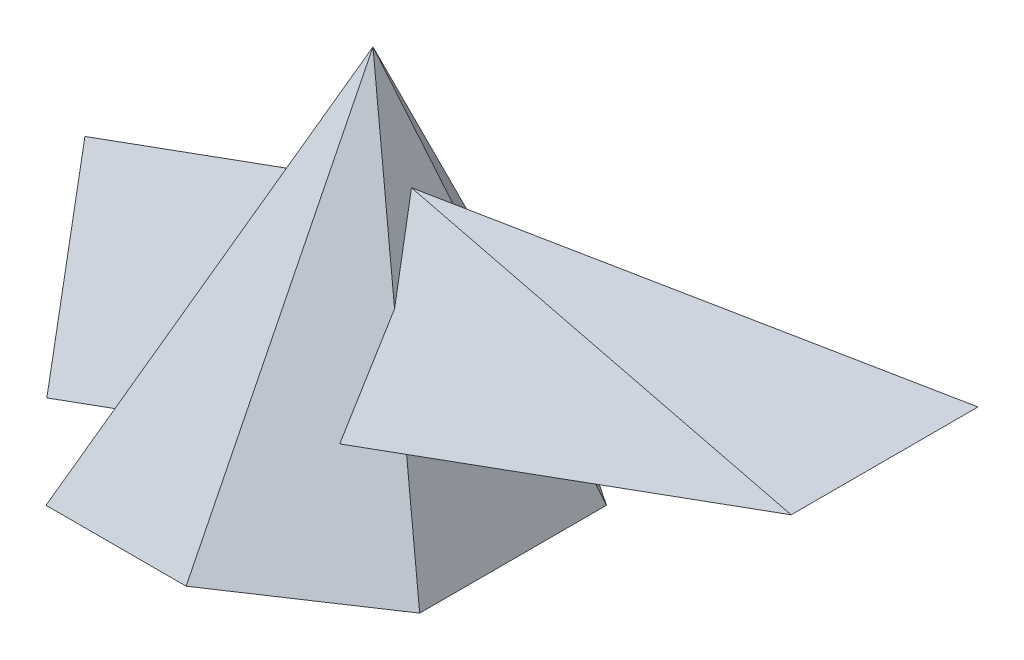
ISO-10303-21;
HEADER;
FILE_DESCRIPTION(('STEP AP214'),'2;1');
FILE_NAME('part.step','',(''),(''),'','','');
FILE_SCHEMA(('AUTOMOTIVE_DESIGN { 1 0 10303 214 1 1 1 1 }'));
ENDSEC;
DATA;
#1=APPLICATION_CONTEXT('core data for automotive mechanical design processes');
#2=APPLICATION_PROTOCOL_DEFINITION('international standard','automotive_design',2000,#1);
#3=PRODUCT_CONTEXT('',#1,'mechanical');
#4=PRODUCT('Part','Part','',(#3));
#5=PRODUCT_RELATED_PRODUCT_CATEGORY('part','',(#4));
#6=PRODUCT_DEFINITION_FORMATION('','',#4);
#7=PRODUCT_DEFINITION_CONTEXT('part definition',#1,'design');
#8=PRODUCT_DEFINITION('design','',#6,#7);
#9=PRODUCT_DEFINITION_SHAPE('','',#8);
#10=(LENGTH_UNIT() NAMED_UNIT(*) SI_UNIT(.MILLI.,.METRE.));
#11=(NAMED_UNIT(*) PLANE_ANGLE_UNIT() SI_UNIT($,.RADIAN.));
#12=(NAMED_UNIT(*) SI_UNIT($,.STERADIAN.) SOLID_ANGLE_UNIT());
#13=UNCERTAINTY_MEASURE_WITH_UNIT(LENGTH_MEASURE(1.E-05),#10,'distance_accuracy_value','');
#14=(GEOMETRIC_REPRESENTATION_CONTEXT(3) GLOBAL_UNCERTAINTY_ASSIGNED_CONTEXT((#13)) GLOBAL_UNIT_ASSIGNED_CONTEXT((#10,
#11,#12)) REPRESENTATION_CONTEXT('',''));
#15=CARTESIAN_POINT('',(0.,0.,0.));
#16=DIRECTION('',(0.,0.,1.));
#17=DIRECTION('',(1.,0.,0.));
#18=AXIS2_PLACEMENT_3D('',#15,#16,#17);
#19=CARTESIAN_POINT('',(52.6027397260274,19.7260273972603,0.));
#20=DIRECTION('',(-0.936329177569044,-0.351123441588392,0.));
#21=DIRECTION('',(0.351123441588392,-0.936329177569045,0.));
#22=AXIS2_PLACEMENT_3D('',#19,#20,#21);
#23=PLANE('',#22);
#24=DIRECTION('',(-0.304085400167954,0.810894400447878,-0.499982340415111));
#25=VECTOR('',#24,1.);
#26=CARTESIAN_POINT('',(49.0148082534701,29.2938446574132,17.6996791747224));
#27=LINE('',#26,#25);
#28=CARTESIAN_POINT('',(43.8763095888053,42.9965077631859,9.25087305920352));
#29=VERTEX_POINT('',#28);
#30=CARTESIAN_POINT('',(38.25,58.,0.));
#31=VERTEX_POINT('',#30);
#32=EDGE_CURVE('E160',#29,#31,#27,.T.);
#33=ORIENTED_EDGE('',*,*,#32,.T.);
#34=DIRECTION('',(0.304085400167954,-0.810894400447878,-0.499982340415111));
#35=VECTOR('',#34,1.);
#36=CARTESIAN_POINT('',(49.0148082534701,29.2938446574132,-17.6996791747224));
#37=LINE('',#36,#35);
#38=CARTESIAN_POINT('',(43.8763095888053,42.9965077631859,-9.25087305920354));
#39=VERTEX_POINT('',#38);
#40=EDGE_CURVE('E166',#31,#39,#37,.T.);
#41=ORIENTED_EDGE('',*,*,#40,.T.);
#42=DIRECTION('',(-0.341881729378914,0.911684611677104,0.227921152919276));
#43=VECTOR('',#42,1.);
#44=CARTESIAN_POINT('',(60.,0.,-20.));
#45=LINE('',#44,#43);
#46=CARTESIAN_POINT('',(30.,80.,0.));
#47=VERTEX_POINT('',#46);
#48=EDGE_CURVE('E346',#39,#47,#45,.T.);
#49=ORIENTED_EDGE('',*,*,#48,.T.);
#50=DIRECTION('',(-0.341881729378914,0.911684611677104,-0.227921152919276));
#51=VECTOR('',#50,1.);
#52=CARTESIAN_POINT('',(60.,0.,20.));
#53=LINE('',#52,#51);
#54=EDGE_CURVE('E172',#29,#47,#53,.T.);
#55=ORIENTED_EDGE('',*,*,#54,.F.);
#56=EDGE_LOOP('',(#33,#41,#49,#55));
#57=FACE_BOUND('',#56,.T.);
#58=ADVANCED_FACE('F41',(#57),#23,.F.);
#59=CARTESIAN_POINT('',(0.,0.,0.));
#60=DIRECTION('',(0.,1.,0.));
#61=DIRECTION('',(0.,0.,1.));
#62=AXIS2_PLACEMENT_3D('',#59,#60,#61);
#63=PLANE('',#62);
#64=DIRECTION('',(-1.,0.,0.));
#65=VECTOR('',#64,1.);
#66=CARTESIAN_POINT('',(30.,0.,-40.));
#67=LINE('',#66,#65);
#68=CARTESIAN_POINT('',(30.,0.,-40.));
#69=VERTEX_POINT('',#68);
#70=CARTESIAN_POINT('',(0.,0.,-40.));
#71=VERTEX_POINT('',#70);
#72=EDGE_CURVE('E221',#69,#71,#67,.T.);
#73=ORIENTED_EDGE('',*,*,#72,.F.);
#74=DIRECTION('',(-0.832050294337844,0.,-0.554700196225229));
#75=VECTOR('',#74,1.);
#76=CARTESIAN_POINT('',(60.,0.,-20.));
#77=LINE('',#76,#75);
#78=CARTESIAN_POINT('',(60.,0.,-20.));
#79=VERTEX_POINT('',#78);
#80=EDGE_CURVE('E178',#79,#69,#77,.T.);
#81=ORIENTED_EDGE('',*,*,#80,.F.);
#82=DIRECTION('',(0.,0.,-1.));
#83=VECTOR('',#82,1.);
#84=CARTESIAN_POINT('',(60.,0.,20.));
#85=LINE('',#84,#83);
#86=CARTESIAN_POINT('',(60.,0.,20.));
#87=VERTEX_POINT('',#86);
#88=EDGE_CURVE('E227',#87,#79,#85,.T.);
#89=ORIENTED_EDGE('',*,*,#88,.F.);
#90=DIRECTION('',(0.832050294337844,0.,-0.554700196225229));
#91=VECTOR('',#90,1.);
#92=CARTESIAN_POINT('',(30.,0.,40.));
#93=LINE('',#92,#91);
#94=CARTESIAN_POINT('',(30.,0.,40.));
#95=VERTEX_POINT('',#94);
#96=EDGE_CURVE('E245',#95,#87,#93,.T.);
#97=ORIENTED_EDGE('',*,*,#96,.F.);
#98=DIRECTION('',(1.,0.,0.));
#99=VECTOR('',#98,1.);
#100=CARTESIAN_POINT('',(0.,0.,40.));
#101=LINE('',#100,#99);
#102=CARTESIAN_POINT('',(0.,0.,40.));
#103=VERTEX_POINT('',#102);
#104=EDGE_CURVE('E248',#103,#95,#101,.T.);
#105=ORIENTED_EDGE('',*,*,#104,.F.);
#106=DIRECTION('',(0.,0.,1.));
#107=VECTOR('',#106,1.);
#108=CARTESIAN_POINT('',(0.,0.,-40.));
#109=LINE('',#108,#107);
#110=EDGE_CURVE('E266',#71,#103,#109,.T.);
#111=ORIENTED_EDGE('',*,*,#110,.F.);
#112=EDGE_LOOP('',(#73,#81,#89,#97,#105,#111));
#113=FACE_BOUND('',#112,.T.);
#114=ADVANCED_FACE('F197',(#113),#63,.F.);
#115=CARTESIAN_POINT('',(23.6065573770492,17.7049180327869,-35.4098360655738));
#116=DIRECTION('',(-0.512147519731584,-0.384110639798688,0.768221279597376));
#117=DIRECTION('',(0.832050294337844,0.,0.554700196225229));
#118=AXIS2_PLACEMENT_3D('',#115,#116,#117);
#119=PLANE('',#118);
#120=ORIENTED_EDGE('',*,*,#48,.F.);
#121=DIRECTION('',(-0.0433970649010113,-0.881712208041471,-0.46978748062141));
#122=VECTOR('',#121,1.);
#123=CARTESIAN_POINT('',(42.3370719174574,11.7233179979222,-25.9136263894006));
#124=LINE('',#123,#122);
#125=CARTESIAN_POINT('',(42.8833487741366,22.8222016344845,-20.));
#126=VERTEX_POINT('',#125);
#127=EDGE_CURVE('E169',#39,#126,#124,.T.);
#128=ORIENTED_EDGE('',*,*,#127,.T.);
#129=DIRECTION('',(0.734681837048884,0.26740232034181,0.623489051536828));
#130=VECTOR('',#129,1.);
#131=CARTESIAN_POINT('',(24.4145155462493,16.1000960779068,-35.6736082635471));
#132=LINE('',#131,#130);
#133=CARTESIAN_POINT('',(50.4138456236469,25.5630783369416,-13.6092304157646));
#134=VERTEX_POINT('',#133);
#135=EDGE_CURVE('E154',#126,#134,#132,.T.);
#136=ORIENTED_EDGE('',*,*,#135,.T.);
#137=EDGE_CURVE('E184',#79,#134,#45,.T.);
#138=ORIENTED_EDGE('',*,*,#137,.F.);
#139=ORIENTED_EDGE('',*,*,#80,.T.);
#140=DIRECTION('',(0.,0.894427190999916,0.447213595499958));
#141=VECTOR('',#140,1.);
#142=CARTESIAN_POINT('',(30.,0.,-40.));
#143=LINE('',#142,#141);
#144=EDGE_CURVE('E343',#69,#47,#143,.T.);
#145=ORIENTED_EDGE('',*,*,#144,.T.);
#146=EDGE_LOOP('',(#120,#128,#136,#138,#139,#145));
#147=FACE_BOUND('',#146,.T.);
#148=ADVANCED_FACE('F186',(#147),#119,.F.);
#149=ORIENTED_EDGE('',*,*,#137,.T.);
#150=DIRECTION('',(0.,0.,1.));
#151=VECTOR('',#150,1.);
#152=CARTESIAN_POINT('',(50.4138456236469,25.5630783369416,0.));
#153=LINE('',#152,#151);
#154=CARTESIAN_POINT('',(50.4138456236469,25.5630783369417,13.6092304157646));
#155=VERTEX_POINT('',#154);
#156=EDGE_CURVE('E145',#134,#155,#153,.T.);
#157=ORIENTED_EDGE('',*,*,#156,.T.);
#158=EDGE_CURVE('E283',#87,#155,#53,.T.);
#159=ORIENTED_EDGE('',*,*,#158,.F.);
#160=ORIENTED_EDGE('',*,*,#88,.T.);
#161=EDGE_LOOP('',(#149,#157,#159,#160));
#162=FACE_BOUND('',#161,.T.);
#163=ADVANCED_FACE('F196',(#162),#23,.F.);
#164=CARTESIAN_POINT('',(0.,16.,-32.));
#165=DIRECTION('',(0.,-0.447213595499958,0.894427190999916));
#166=DIRECTION('',(0.,-0.894427190999916,-0.447213595499958));
#167=AXIS2_PLACEMENT_3D('',#164,#165,#166);
#168=PLANE('',#167);
#169=DIRECTION('',(0.317999364001908,0.847998304005088,0.423999152002544));
#170=VECTOR('',#169,1.);
#171=CARTESIAN_POINT('',(0.,0.,-40.));
#172=LINE('',#171,#170);
#173=EDGE_CURVE('E337',#71,#47,#172,.T.);
#174=ORIENTED_EDGE('',*,*,#173,.T.);
#175=ORIENTED_EDGE('',*,*,#144,.F.);
#176=ORIENTED_EDGE('',*,*,#72,.T.);
#177=EDGE_LOOP('',(#174,#175,#176));
#178=FACE_BOUND('',#177,.T.);
#179=ADVANCED_FACE('F203',(#178),#168,.F.);
#180=CARTESIAN_POINT('',(0.,0.,0.));
#181=DIRECTION('',(0.936329177569044,-0.351123441588392,0.));
#182=DIRECTION('',(0.351123441588392,0.936329177569045,0.));
#183=AXIS2_PLACEMENT_3D('',#180,#181,#182);
#184=PLANE('',#183);
#185=DIRECTION('',(0.,0.,-1.));
#186=VECTOR('',#185,1.);
#187=CARTESIAN_POINT('',(3.13282247435555,8.35419326494811,0.));
#188=LINE('',#187,#186);
#189=CARTESIAN_POINT('',(3.13282247435553,8.35419326494812,20.));
#190=VERTEX_POINT('',#189);
#191=CARTESIAN_POINT('',(3.13282247435554,8.35419326494811,-20.));
#192=VERTEX_POINT('',#191);
#193=EDGE_CURVE('E157',#190,#192,#188,.T.);
#194=ORIENTED_EDGE('',*,*,#193,.T.);
#195=DIRECTION('',(0.321547952136274,0.85746120569673,0.401705358692262));
#196=VECTOR('',#195,1.);
#197=CARTESIAN_POINT('',(3.08888548474607,8.23702795932286,-20.054889866515));
#198=LINE('',#197,#196);
#199=CARTESIAN_POINT('',(19.1419667478132,51.0452446608351,0.));
#200=VERTEX_POINT('',#199);
#201=EDGE_CURVE('E50',#192,#200,#198,.T.);
#202=ORIENTED_EDGE('',*,*,#201,.T.);
#203=DIRECTION('',(-0.321547952136274,-0.85746120569673,0.401705358692263));
#204=VECTOR('',#203,1.);
#205=CARTESIAN_POINT('',(3.08888548474609,8.23702795932288,20.054889866515));
#206=LINE('',#205,#204);
#207=EDGE_CURVE('E163',#200,#190,#206,.T.);
#208=ORIENTED_EDGE('',*,*,#207,.T.);
#209=EDGE_LOOP('',(#194,#202,#208));
#210=FACE_BOUND('',#209,.T.);
#211=DIRECTION('',(0.317999364001908,0.847998304005088,-0.423999152002544));
#212=VECTOR('',#211,1.);
#213=CARTESIAN_POINT('',(0.,0.,40.));
#214=LINE('',#213,#212);
#215=EDGE_CURVE('E307',#103,#47,#214,.T.);
#216=ORIENTED_EDGE('',*,*,#215,.T.);
#217=ORIENTED_EDGE('',*,*,#173,.F.);
#218=ORIENTED_EDGE('',*,*,#110,.T.);
#219=EDGE_LOOP('',(#216,#217,#218));
#220=FACE_BOUND('',#219,.T.);
#221=ADVANCED_FACE('F320',(#210,#220),#184,.F.);
#222=CARTESIAN_POINT('',(0.,16.,32.));
#223=DIRECTION('',(0.,-0.447213595499958,-0.894427190999916));
#224=DIRECTION('',(0.,0.894427190999916,-0.447213595499958));
#225=AXIS2_PLACEMENT_3D('',#222,#223,#224);
#226=PLANE('',#225);
#227=DIRECTION('',(0.,0.894427190999916,-0.447213595499958));
#228=VECTOR('',#227,1.);
#229=CARTESIAN_POINT('',(30.,0.,40.));
#230=LINE('',#229,#228);
#231=EDGE_CURVE('E290',#95,#47,#230,.T.);
#232=ORIENTED_EDGE('',*,*,#231,.T.);
#233=ORIENTED_EDGE('',*,*,#215,.F.);
#234=ORIENTED_EDGE('',*,*,#104,.T.);
#235=EDGE_LOOP('',(#232,#233,#234));
#236=FACE_BOUND('',#235,.T.);
#237=ADVANCED_FACE('F312',(#236),#226,.F.);
#238=CARTESIAN_POINT('',(23.6065573770492,17.7049180327869,35.4098360655738));
#239=DIRECTION('',(-0.512147519731584,-0.384110639798688,-0.768221279597376));
#240=DIRECTION('',(-0.832050294337844,0.,0.554700196225229));
#241=AXIS2_PLACEMENT_3D('',#238,#239,#240);
#242=PLANE('',#241);
#243=DIRECTION('',(-0.734681837048884,-0.26740232034181,0.623489051536828));
#244=VECTOR('',#243,1.);
#245=CARTESIAN_POINT('',(24.4145155462493,16.1000960779068,35.6736082635471));
#246=LINE('',#245,#244);
#247=CARTESIAN_POINT('',(42.8833487741366,22.8222016344845,20.));
#248=VERTEX_POINT('',#247);
#249=EDGE_CURVE('E226',#155,#248,#246,.T.);
#250=ORIENTED_EDGE('',*,*,#249,.T.);
#251=DIRECTION('',(0.0433970649010116,0.881712208041471,-0.46978748062141));
#252=VECTOR('',#251,1.);
#253=CARTESIAN_POINT('',(42.3370719174574,11.7233179979222,25.9136263894007));
#254=LINE('',#253,#252);
#255=EDGE_CURVE('E139',#248,#29,#254,.T.);
#256=ORIENTED_EDGE('',*,*,#255,.T.);
#257=ORIENTED_EDGE('',*,*,#54,.T.);
#258=ORIENTED_EDGE('',*,*,#231,.F.);
#259=ORIENTED_EDGE('',*,*,#96,.T.);
#260=ORIENTED_EDGE('',*,*,#158,.T.);
#261=EDGE_LOOP('',(#250,#256,#257,#258,#259,#260));
#262=FACE_BOUND('',#261,.T.);
#263=ADVANCED_FACE('F43',(#262),#242,.F.);
#264=CARTESIAN_POINT('',(144.067187387632,59.6501070785924,20.));
#265=DIRECTION('',(0.342020143325673,-0.939692620785907,0.));
#266=DIRECTION('',(0.939692620785907,0.342020143325673,0.));
#267=AXIS2_PLACEMENT_3D('',#264,#265,#266);
#268=PLANE('',#267);
#269=DIRECTION('',(0.,0.,1.));
#270=VECTOR('',#269,1.);
#271=CARTESIAN_POINT('',(139.533555449517,58.,-40.0001));
#272=LINE('',#271,#270);
#273=CARTESIAN_POINT('',(139.533555449517,58.,-20.));
#274=VERTEX_POINT('',#273);
#275=CARTESIAN_POINT('',(139.533555449517,58.,20.));
#276=VERTEX_POINT('',#275);
#277=EDGE_CURVE('E56',#274,#276,#272,.T.);
#278=ORIENTED_EDGE('',*,*,#277,.T.);
#279=DIRECTION('',(-0.939692620785907,-0.342020143325673,0.));
#280=VECTOR('',#279,1.);
#281=CARTESIAN_POINT('',(144.067187387632,59.6501070785924,20.));
#282=LINE('',#281,#280);
#283=EDGE_CURVE('E132',#276,#248,#282,.T.);
#284=ORIENTED_EDGE('',*,*,#283,.T.);
#285=ORIENTED_EDGE('',*,*,#249,.F.);
#286=ORIENTED_EDGE('',*,*,#156,.F.);
#287=ORIENTED_EDGE('',*,*,#135,.F.);
#288=DIRECTION('',(-0.939692620785907,-0.342020143325673,0.));
#289=VECTOR('',#288,1.);
#290=CARTESIAN_POINT('',(144.067187387632,59.6501070785924,-20.));
#291=LINE('',#290,#289);
#292=EDGE_CURVE('E135',#274,#126,#291,.T.);
#293=ORIENTED_EDGE('',*,*,#292,.F.);
#294=EDGE_LOOP('',(#278,#284,#285,#286,#287,#293));
#295=FACE_BOUND('',#294,.T.);
#296=ADVANCED_FACE('F131',(#295),#268,.T.);
#297=CARTESIAN_POINT('',(132.219262078591,92.2020143325673,0.));
#298=DIRECTION('',(-0.171010071662836,0.469846310392954,0.866025403784439));
#299=DIRECTION('',(0.,-0.878973312975219,0.476870962711473));
#300=AXIS2_PLACEMENT_3D('',#297,#298,#299);
#301=PLANE('',#300);
#302=DIRECTION('',(0.981055946010023,0.,0.19372462620529));
#303=VECTOR('',#302,1.);
#304=CARTESIAN_POINT('',(128.69266795409,58.,17.859299577841));
#305=LINE('',#304,#303);
#306=EDGE_CURVE('E122',#31,#276,#305,.T.);
#307=ORIENTED_EDGE('',*,*,#306,.F.);
#308=ORIENTED_EDGE('',*,*,#32,.F.);
#309=ORIENTED_EDGE('',*,*,#255,.F.);
#310=ORIENTED_EDGE('',*,*,#283,.F.);
#311=EDGE_LOOP('',(#307,#308,#309,#310));
#312=FACE_BOUND('',#311,.T.);
#313=ADVANCED_FACE('F137',(#312),#301,.T.);
#314=CARTESIAN_POINT('',(144.067187387632,59.6501070785924,-20.));
#315=DIRECTION('',(-0.171010071662837,0.469846310392953,-0.866025403784439));
#316=DIRECTION('',(0.,0.878973312975219,0.476870962711473));
#317=AXIS2_PLACEMENT_3D('',#314,#315,#316);
#318=PLANE('',#317);
#319=DIRECTION('',(-0.981055946010023,0.,0.19372462620529));
#320=VECTOR('',#319,1.);
#321=CARTESIAN_POINT('',(143.897043668271,58.,-20.8616380417114));
#322=LINE('',#321,#320);
#323=EDGE_CURVE('E12',#274,#31,#322,.T.);
#324=ORIENTED_EDGE('',*,*,#323,.F.);
#325=ORIENTED_EDGE('',*,*,#292,.T.);
#326=ORIENTED_EDGE('',*,*,#127,.F.);
#327=ORIENTED_EDGE('',*,*,#40,.F.);
#328=EDGE_LOOP('',(#324,#325,#326,#327));
#329=FACE_BOUND('',#328,.T.);
#330=ADVANCED_FACE('F368',(#329),#318,.T.);
#331=DIRECTION('',(0.296198132726027,-0.813797681349372,-0.5));
#332=VECTOR('',#331,1.);
#333=CARTESIAN_POINT('',(-19.820134878849,0.,-20.));
#334=LINE('',#333,#332);
#335=CARTESIAN_POINT('',(-31.6680601878901,32.5519072539749,0.));
#336=VERTEX_POINT('',#335);
#337=CARTESIAN_POINT('',(-19.820134878849,0.,-20.));
#338=VERTEX_POINT('',#337);
#339=EDGE_CURVE('E64',#336,#338,#334,.T.);
#340=ORIENTED_EDGE('',*,*,#339,.F.);
#341=DIRECTION('',(-0.939692620785907,-0.342020143325673,0.));
#342=VECTOR('',#341,1.);
#343=CARTESIAN_POINT('',(132.219262078591,92.2020143325673,0.));
#344=LINE('',#343,#342);
#345=EDGE_CURVE('E141',#200,#336,#344,.T.);
#346=ORIENTED_EDGE('',*,*,#345,.F.);
#347=ORIENTED_EDGE('',*,*,#201,.F.);
#348=EDGE_CURVE('E151',#192,#338,#291,.T.);
#349=ORIENTED_EDGE('',*,*,#348,.T.);
#350=EDGE_LOOP('',(#340,#346,#347,#349));
#351=FACE_BOUND('',#350,.T.);
#352=ADVANCED_FACE('F403',(#351),#318,.T.);
#353=DIRECTION('',(-0.296198132726027,0.813797681349372,-0.5));
#354=VECTOR('',#353,1.);
#355=CARTESIAN_POINT('',(-31.6680601878901,32.5519072539749,0.));
#356=LINE('',#355,#354);
#357=CARTESIAN_POINT('',(-19.820134878849,0.,20.));
#358=VERTEX_POINT('',#357);
#359=EDGE_CURVE('E486',#358,#336,#356,.T.);
#360=ORIENTED_EDGE('',*,*,#359,.F.);
#361=EDGE_CURVE('E142',#190,#358,#282,.T.);
#362=ORIENTED_EDGE('',*,*,#361,.F.);
#363=ORIENTED_EDGE('',*,*,#207,.F.);
#364=ORIENTED_EDGE('',*,*,#345,.T.);
#365=EDGE_LOOP('',(#360,#362,#363,#364));
#366=FACE_BOUND('',#365,.T.);
#367=ADVANCED_FACE('F408',(#366),#301,.T.);
#368=DIRECTION('',(0.,0.,1.));
#369=VECTOR('',#368,1.);
#370=CARTESIAN_POINT('',(-19.820134878849,0.,-40.0001));
#371=LINE('',#370,#369);
#372=EDGE_CURVE('E127',#338,#358,#371,.T.);
#373=ORIENTED_EDGE('',*,*,#372,.F.);
#374=ORIENTED_EDGE('',*,*,#348,.F.);
#375=ORIENTED_EDGE('',*,*,#193,.F.);
#376=ORIENTED_EDGE('',*,*,#361,.T.);
#377=EDGE_LOOP('',(#373,#374,#375,#376));
#378=FACE_BOUND('',#377,.T.);
#379=ADVANCED_FACE('F419',(#378),#268,.T.);
#380=CARTESIAN_POINT('',(-31.6680601878901,32.5519072539749,-40.0001));
#381=DIRECTION('',(0.939692620785907,0.342020143325673,0.));
#382=DIRECTION('',(-0.342020143325673,0.939692620785907,0.));
#383=AXIS2_PLACEMENT_3D('',#380,#381,#382);
#384=PLANE('',#383);
#385=ORIENTED_EDGE('',*,*,#339,.T.);
#386=ORIENTED_EDGE('',*,*,#372,.T.);
#387=ORIENTED_EDGE('',*,*,#359,.T.);
#388=EDGE_LOOP('',(#385,#386,#387));
#389=FACE_BOUND('',#388,.T.);
#390=ADVANCED_FACE('F429',(#389),#384,.F.);
#391=CARTESIAN_POINT('',(38.25,58.,-40.0001));
#392=DIRECTION('',(0.,-1.,0.));
#393=DIRECTION('',(0.,0.,-1.));
#394=AXIS2_PLACEMENT_3D('',#391,#392,#393);
#395=PLANE('',#394);
#396=ORIENTED_EDGE('',*,*,#306,.T.);
#397=ORIENTED_EDGE('',*,*,#277,.F.);
#398=ORIENTED_EDGE('',*,*,#323,.T.);
#399=EDGE_LOOP('',(#396,#397,#398));
#400=FACE_BOUND('',#399,.T.);
#401=ADVANCED_FACE('F123',(#400),#395,.F.);
#402=CLOSED_SHELL('',(#58,#114,#148,#163,#179,#221,#237,#263,#296,#313,#330,#352,#367,#379,#390,#401));
#403=MANIFOLD_SOLID_BREP('B2',#402);
#404=ADVANCED_BREP_SHAPE_REPRESENTATION('',(#18,#403),#14);
#405=SHAPE_DEFINITION_REPRESENTATION(#9,#404);
ENDSEC;
END-ISO-10303-21;
